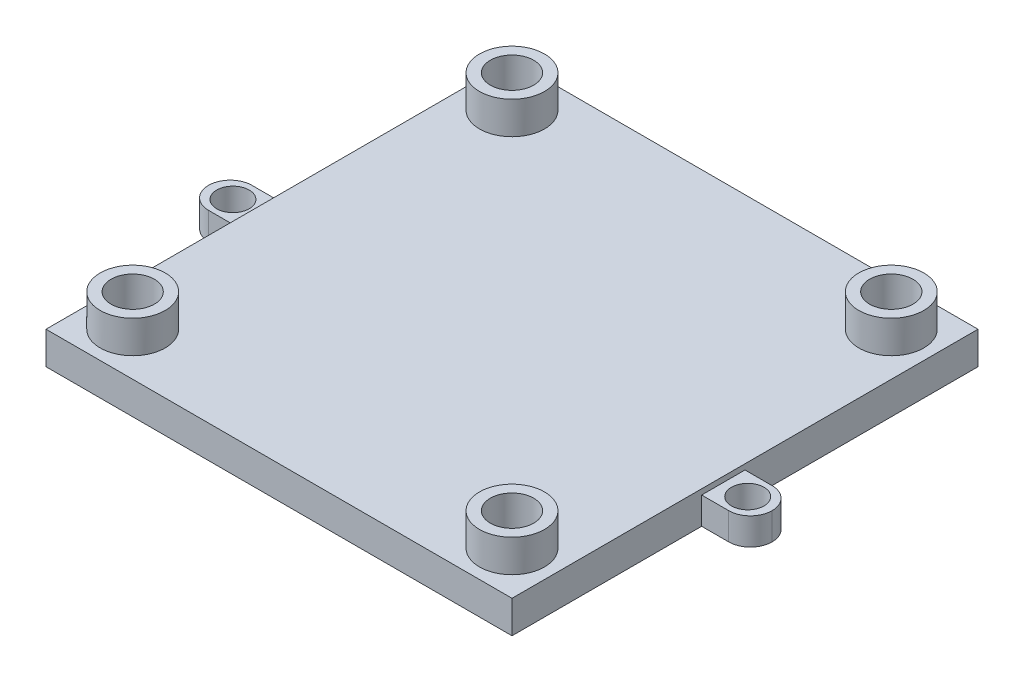
ISO-10303-21;
HEADER;
FILE_DESCRIPTION(('STEP AP214'),'2;1');
FILE_NAME('part.step','',(''),(''),'','','');
FILE_SCHEMA(('AUTOMOTIVE_DESIGN { 1 0 10303 214 1 1 1 1 }'));
ENDSEC;
DATA;
#1=APPLICATION_CONTEXT('core data for automotive mechanical design processes');
#2=APPLICATION_PROTOCOL_DEFINITION('international standard','automotive_design',2000,#1);
#3=PRODUCT_CONTEXT('',#1,'mechanical');
#4=PRODUCT('Part','Part','',(#3));
#5=PRODUCT_RELATED_PRODUCT_CATEGORY('part','',(#4));
#6=PRODUCT_DEFINITION_FORMATION('','',#4);
#7=PRODUCT_DEFINITION_CONTEXT('part definition',#1,'design');
#8=PRODUCT_DEFINITION('design','',#6,#7);
#9=PRODUCT_DEFINITION_SHAPE('','',#8);
#10=(LENGTH_UNIT() NAMED_UNIT(*) SI_UNIT(.MILLI.,.METRE.));
#11=(NAMED_UNIT(*) PLANE_ANGLE_UNIT() SI_UNIT($,.RADIAN.));
#12=(NAMED_UNIT(*) SI_UNIT($,.STERADIAN.) SOLID_ANGLE_UNIT());
#13=UNCERTAINTY_MEASURE_WITH_UNIT(LENGTH_MEASURE(1.E-05),#10,'distance_accuracy_value','');
#14=(GEOMETRIC_REPRESENTATION_CONTEXT(3) GLOBAL_UNCERTAINTY_ASSIGNED_CONTEXT((#13)) GLOBAL_UNIT_ASSIGNED_CONTEXT((#10,
#11,#12)) REPRESENTATION_CONTEXT('',''));
#15=CARTESIAN_POINT('',(0.,0.,0.));
#16=DIRECTION('',(0.,0.,1.));
#17=DIRECTION('',(1.,0.,0.));
#18=AXIS2_PLACEMENT_3D('',#15,#16,#17);
#19=CARTESIAN_POINT('',(43.,3.,0.));
#20=DIRECTION('',(-1.,0.,0.));
#21=DIRECTION('',(0.,0.,1.));
#22=AXIS2_PLACEMENT_3D('',#19,#20,#21);
#23=PLANE('',#22);
#24=DIRECTION('',(0.,-1.,0.));
#25=VECTOR('',#24,1.);
#26=CARTESIAN_POINT('',(43.,2.5,-17.5));
#27=LINE('',#26,#25);
#28=CARTESIAN_POINT('',(43.,2.5,-17.5));
#29=VERTEX_POINT('',#28);
#30=CARTESIAN_POINT('',(43.,0.,-17.5));
#31=VERTEX_POINT('',#30);
#32=EDGE_CURVE('E170',#29,#31,#27,.T.);
#33=ORIENTED_EDGE('',*,*,#32,.F.);
#34=DIRECTION('',(0.,0.,-1.));
#35=VECTOR('',#34,1.);
#36=CARTESIAN_POINT('',(43.,2.5,-21.5));
#37=LINE('',#36,#35);
#38=CARTESIAN_POINT('',(43.,2.5,-21.5));
#39=VERTEX_POINT('',#38);
#40=EDGE_CURVE('E175',#29,#39,#37,.T.);
#41=ORIENTED_EDGE('',*,*,#40,.T.);
#42=DIRECTION('',(0.,-1.,0.));
#43=VECTOR('',#42,1.);
#44=CARTESIAN_POINT('',(43.,2.5,-21.5));
#45=LINE('',#44,#43);
#46=CARTESIAN_POINT('',(43.,0.,-21.5));
#47=VERTEX_POINT('',#46);
#48=EDGE_CURVE('E159',#39,#47,#45,.T.);
#49=ORIENTED_EDGE('',*,*,#48,.T.);
#50=DIRECTION('',(0.,0.,-1.));
#51=VECTOR('',#50,1.);
#52=CARTESIAN_POINT('',(43.,0.,0.));
#53=LINE('',#52,#51);
#54=CARTESIAN_POINT('',(43.,0.,-43.));
#55=VERTEX_POINT('',#54);
#56=EDGE_CURVE('E259',#47,#55,#53,.T.);
#57=ORIENTED_EDGE('',*,*,#56,.T.);
#58=DIRECTION('',(0.,-1.,0.));
#59=VECTOR('',#58,1.);
#60=CARTESIAN_POINT('',(43.,3.,-43.));
#61=LINE('',#60,#59);
#62=CARTESIAN_POINT('',(43.,3.,-43.));
#63=VERTEX_POINT('',#62);
#64=EDGE_CURVE('E265',#63,#55,#61,.T.);
#65=ORIENTED_EDGE('',*,*,#64,.F.);
#66=DIRECTION('',(0.,0.,-1.));
#67=VECTOR('',#66,1.);
#68=CARTESIAN_POINT('',(43.,3.,0.));
#69=LINE('',#68,#67);
#70=CARTESIAN_POINT('',(43.,3.,0.));
#71=VERTEX_POINT('',#70);
#72=EDGE_CURVE('E249',#71,#63,#69,.T.);
#73=ORIENTED_EDGE('',*,*,#72,.F.);
#74=DIRECTION('',(0.,-1.,0.));
#75=VECTOR('',#74,1.);
#76=CARTESIAN_POINT('',(43.,3.,0.));
#77=LINE('',#76,#75);
#78=CARTESIAN_POINT('',(43.,0.,0.));
#79=VERTEX_POINT('',#78);
#80=EDGE_CURVE('E268',#71,#79,#77,.T.);
#81=ORIENTED_EDGE('',*,*,#80,.T.);
#82=EDGE_CURVE('E260',#79,#31,#53,.T.);
#83=ORIENTED_EDGE('',*,*,#82,.T.);
#84=EDGE_LOOP('',(#33,#41,#49,#57,#65,#73,#81,#83));
#85=FACE_BOUND('',#84,.T.);
#86=ADVANCED_FACE('F58',(#85),#23,.F.);
#87=CARTESIAN_POINT('',(0.,3.,0.));
#88=DIRECTION('',(1.,0.,0.));
#89=DIRECTION('',(0.,0.,-1.));
#90=AXIS2_PLACEMENT_3D('',#87,#88,#89);
#91=PLANE('',#90);
#92=DIRECTION('',(0.,-1.,0.));
#93=VECTOR('',#92,1.);
#94=CARTESIAN_POINT('',(0.,2.5,-21.5));
#95=LINE('',#94,#93);
#96=CARTESIAN_POINT('',(0.,2.5,-21.5));
#97=VERTEX_POINT('',#96);
#98=CARTESIAN_POINT('',(0.,0.,-21.5));
#99=VERTEX_POINT('',#98);
#100=EDGE_CURVE('E213',#97,#99,#95,.T.);
#101=ORIENTED_EDGE('',*,*,#100,.F.);
#102=DIRECTION('',(0.,0.,1.));
#103=VECTOR('',#102,1.);
#104=CARTESIAN_POINT('',(0.,2.5,-21.5));
#105=LINE('',#104,#103);
#106=CARTESIAN_POINT('',(0.,2.5,-17.5));
#107=VERTEX_POINT('',#106);
#108=EDGE_CURVE('E200',#97,#107,#105,.T.);
#109=ORIENTED_EDGE('',*,*,#108,.T.);
#110=DIRECTION('',(0.,-1.,0.));
#111=VECTOR('',#110,1.);
#112=CARTESIAN_POINT('',(0.,2.5,-17.5));
#113=LINE('',#112,#111);
#114=CARTESIAN_POINT('',(0.,0.,-17.5));
#115=VERTEX_POINT('',#114);
#116=EDGE_CURVE('E209',#107,#115,#113,.T.);
#117=ORIENTED_EDGE('',*,*,#116,.T.);
#118=DIRECTION('',(0.,0.,1.));
#119=VECTOR('',#118,1.);
#120=CARTESIAN_POINT('',(0.,0.,0.));
#121=LINE('',#120,#119);
#122=CARTESIAN_POINT('',(0.,0.,0.));
#123=VERTEX_POINT('',#122);
#124=EDGE_CURVE('E242',#115,#123,#121,.T.);
#125=ORIENTED_EDGE('',*,*,#124,.T.);
#126=DIRECTION('',(0.,-1.,0.));
#127=VECTOR('',#126,1.);
#128=CARTESIAN_POINT('',(0.,3.,0.));
#129=LINE('',#128,#127);
#130=CARTESIAN_POINT('',(0.,3.,0.));
#131=VERTEX_POINT('',#130);
#132=EDGE_CURVE('E271',#131,#123,#129,.T.);
#133=ORIENTED_EDGE('',*,*,#132,.F.);
#134=DIRECTION('',(0.,0.,1.));
#135=VECTOR('',#134,1.);
#136=CARTESIAN_POINT('',(0.,3.,0.));
#137=LINE('',#136,#135);
#138=CARTESIAN_POINT('',(0.,3.,-43.));
#139=VERTEX_POINT('',#138);
#140=EDGE_CURVE('E243',#139,#131,#137,.T.);
#141=ORIENTED_EDGE('',*,*,#140,.F.);
#142=DIRECTION('',(0.,-1.,0.));
#143=VECTOR('',#142,1.);
#144=CARTESIAN_POINT('',(0.,3.,-43.));
#145=LINE('',#144,#143);
#146=CARTESIAN_POINT('',(0.,0.,-43.));
#147=VERTEX_POINT('',#146);
#148=EDGE_CURVE('E253',#139,#147,#145,.T.);
#149=ORIENTED_EDGE('',*,*,#148,.T.);
#150=EDGE_CURVE('E254',#147,#99,#121,.T.);
#151=ORIENTED_EDGE('',*,*,#150,.T.);
#152=EDGE_LOOP('',(#101,#109,#117,#125,#133,#141,#149,#151));
#153=FACE_BOUND('',#152,.T.);
#154=ADVANCED_FACE('F356',(#153),#91,.F.);
#155=CARTESIAN_POINT('',(0.,3.,0.));
#156=DIRECTION('',(0.,0.,-1.));
#157=DIRECTION('',(-1.,0.,0.));
#158=AXIS2_PLACEMENT_3D('',#155,#156,#157);
#159=PLANE('',#158);
#160=DIRECTION('',(1.,0.,0.));
#161=VECTOR('',#160,1.);
#162=CARTESIAN_POINT('',(0.,0.,0.));
#163=LINE('',#162,#161);
#164=EDGE_CURVE('E257',#123,#79,#163,.T.);
#165=ORIENTED_EDGE('',*,*,#164,.T.);
#166=ORIENTED_EDGE('',*,*,#80,.F.);
#167=DIRECTION('',(1.,0.,0.));
#168=VECTOR('',#167,1.);
#169=CARTESIAN_POINT('',(0.,3.,0.));
#170=LINE('',#169,#168);
#171=EDGE_CURVE('E246',#131,#71,#170,.T.);
#172=ORIENTED_EDGE('',*,*,#171,.F.);
#173=ORIENTED_EDGE('',*,*,#132,.T.);
#174=EDGE_LOOP('',(#165,#166,#172,#173));
#175=FACE_BOUND('',#174,.T.);
#176=ADVANCED_FACE('F361',(#175),#159,.F.);
#177=CARTESIAN_POINT('',(0.,3.,-43.));
#178=DIRECTION('',(0.,0.,1.));
#179=DIRECTION('',(1.,0.,0.));
#180=AXIS2_PLACEMENT_3D('',#177,#178,#179);
#181=PLANE('',#180);
#182=DIRECTION('',(-1.,0.,0.));
#183=VECTOR('',#182,1.);
#184=CARTESIAN_POINT('',(0.,0.,-43.));
#185=LINE('',#184,#183);
#186=EDGE_CURVE('E247',#55,#147,#185,.T.);
#187=ORIENTED_EDGE('',*,*,#186,.T.);
#188=ORIENTED_EDGE('',*,*,#148,.F.);
#189=DIRECTION('',(-1.,0.,0.));
#190=VECTOR('',#189,1.);
#191=CARTESIAN_POINT('',(0.,3.,-43.));
#192=LINE('',#191,#190);
#193=EDGE_CURVE('E251',#63,#139,#192,.T.);
#194=ORIENTED_EDGE('',*,*,#193,.F.);
#195=ORIENTED_EDGE('',*,*,#64,.T.);
#196=EDGE_LOOP('',(#187,#188,#194,#195));
#197=FACE_BOUND('',#196,.T.);
#198=ADVANCED_FACE('F349',(#197),#181,.F.);
#199=CARTESIAN_POINT('',(0.,3.,0.));
#200=DIRECTION('',(0.,-1.,0.));
#201=DIRECTION('',(0.,0.,-1.));
#202=AXIS2_PLACEMENT_3D('',#199,#200,#201);
#203=PLANE('',#202);
#204=CARTESIAN_POINT('',(39.,3.,-4.));
#205=DIRECTION('',(0.,-1.,0.));
#206=DIRECTION('',(0.,0.,-1.));
#207=AXIS2_PLACEMENT_3D('',#204,#205,#206);
#208=CIRCLE('',#207,3.);
#209=CARTESIAN_POINT('',(39.,3.,-7.));
#210=VERTEX_POINT('',#209);
#211=EDGE_CURVE('E283',#210,#210,#208,.F.);
#212=ORIENTED_EDGE('',*,*,#211,.F.);
#213=EDGE_LOOP('',(#212));
#214=FACE_BOUND('',#213,.T.);
#215=CARTESIAN_POINT('',(4.,3.,-4.));
#216=DIRECTION('',(0.,-1.,0.));
#217=DIRECTION('',(0.,0.,-1.));
#218=AXIS2_PLACEMENT_3D('',#215,#216,#217);
#219=CIRCLE('',#218,3.);
#220=CARTESIAN_POINT('',(4.,3.,-7.));
#221=VERTEX_POINT('',#220);
#222=EDGE_CURVE('E280',#221,#221,#219,.F.);
#223=ORIENTED_EDGE('',*,*,#222,.F.);
#224=EDGE_LOOP('',(#223));
#225=FACE_BOUND('',#224,.T.);
#226=CARTESIAN_POINT('',(39.,3.,-39.));
#227=DIRECTION('',(0.,-1.,0.));
#228=DIRECTION('',(0.,0.,-1.));
#229=AXIS2_PLACEMENT_3D('',#226,#227,#228);
#230=CIRCLE('',#229,3.);
#231=CARTESIAN_POINT('',(39.,3.,-42.));
#232=VERTEX_POINT('',#231);
#233=EDGE_CURVE('E277',#232,#232,#230,.F.);
#234=ORIENTED_EDGE('',*,*,#233,.F.);
#235=EDGE_LOOP('',(#234));
#236=FACE_BOUND('',#235,.T.);
#237=CARTESIAN_POINT('',(4.,3.,-39.));
#238=DIRECTION('',(0.,-1.,0.));
#239=DIRECTION('',(0.,0.,-1.));
#240=AXIS2_PLACEMENT_3D('',#237,#238,#239);
#241=CIRCLE('',#240,3.);
#242=CARTESIAN_POINT('',(4.,3.,-42.));
#243=VERTEX_POINT('',#242);
#244=EDGE_CURVE('E274',#243,#243,#241,.F.);
#245=ORIENTED_EDGE('',*,*,#244,.F.);
#246=EDGE_LOOP('',(#245));
#247=FACE_BOUND('',#246,.T.);
#248=ORIENTED_EDGE('',*,*,#140,.T.);
#249=ORIENTED_EDGE('',*,*,#171,.T.);
#250=ORIENTED_EDGE('',*,*,#72,.T.);
#251=ORIENTED_EDGE('',*,*,#193,.T.);
#252=EDGE_LOOP('',(#248,#249,#250,#251));
#253=FACE_BOUND('',#252,.T.);
#254=ADVANCED_FACE('F339',(#214,#225,#236,#247,#253),#203,.F.);
#255=CARTESIAN_POINT('',(0.,0.,0.));
#256=DIRECTION('',(0.,-1.,0.));
#257=DIRECTION('',(0.,0.,-1.));
#258=AXIS2_PLACEMENT_3D('',#255,#256,#257);
#259=PLANE('',#258);
#260=CARTESIAN_POINT('',(4.,0.,-4.));
#261=DIRECTION('',(0.,1.,0.));
#262=DIRECTION('',(0.,0.,1.));
#263=AXIS2_PLACEMENT_3D('',#260,#261,#262);
#264=CIRCLE('',#263,2.);
#265=CARTESIAN_POINT('',(4.,0.,-2.));
#266=VERTEX_POINT('',#265);
#267=EDGE_CURVE('E324',#266,#266,#264,.T.);
#268=ORIENTED_EDGE('',*,*,#267,.T.);
#269=EDGE_LOOP('',(#268));
#270=FACE_BOUND('',#269,.T.);
#271=CARTESIAN_POINT('',(39.,0.,-4.));
#272=DIRECTION('',(0.,1.,0.));
#273=DIRECTION('',(0.,0.,1.));
#274=AXIS2_PLACEMENT_3D('',#271,#272,#273);
#275=CIRCLE('',#274,2.);
#276=CARTESIAN_POINT('',(39.,0.,-2.));
#277=VERTEX_POINT('',#276);
#278=EDGE_CURVE('E685',#277,#277,#275,.T.);
#279=ORIENTED_EDGE('',*,*,#278,.T.);
#280=EDGE_LOOP('',(#279));
#281=FACE_BOUND('',#280,.T.);
#282=CARTESIAN_POINT('',(39.,0.,-39.));
#283=DIRECTION('',(0.,1.,0.));
#284=DIRECTION('',(0.,0.,1.));
#285=AXIS2_PLACEMENT_3D('',#282,#283,#284);
#286=CIRCLE('',#285,2.);
#287=CARTESIAN_POINT('',(39.,0.,-37.));
#288=VERTEX_POINT('',#287);
#289=EDGE_CURVE('E319',#288,#288,#286,.T.);
#290=ORIENTED_EDGE('',*,*,#289,.T.);
#291=EDGE_LOOP('',(#290));
#292=FACE_BOUND('',#291,.T.);
#293=CARTESIAN_POINT('',(4.,0.,-39.));
#294=DIRECTION('',(0.,1.,0.));
#295=DIRECTION('',(0.,0.,1.));
#296=AXIS2_PLACEMENT_3D('',#293,#294,#295);
#297=CIRCLE('',#296,2.);
#298=CARTESIAN_POINT('',(4.,0.,-37.));
#299=VERTEX_POINT('',#298);
#300=EDGE_CURVE('E316',#299,#299,#297,.T.);
#301=ORIENTED_EDGE('',*,*,#300,.T.);
#302=EDGE_LOOP('',(#301));
#303=FACE_BOUND('',#302,.T.);
#304=DIRECTION('',(1.,0.,0.));
#305=VECTOR('',#304,1.);
#306=CARTESIAN_POINT('',(43.,0.,-21.5));
#307=LINE('',#306,#305);
#308=CARTESIAN_POINT('',(45.5,0.,-21.5));
#309=VERTEX_POINT('',#308);
#310=EDGE_CURVE('E166',#47,#309,#307,.T.);
#311=ORIENTED_EDGE('',*,*,#310,.T.);
#312=CARTESIAN_POINT('',(45.5,0.,-19.5));
#313=DIRECTION('',(0.,-1.,0.));
#314=DIRECTION('',(0.,0.,-1.));
#315=AXIS2_PLACEMENT_3D('',#312,#313,#314);
#316=CIRCLE('',#315,2.);
#317=CARTESIAN_POINT('',(47.5,0.,-19.5));
#318=VERTEX_POINT('',#317);
#319=EDGE_CURVE('E305',#309,#318,#316,.T.);
#320=ORIENTED_EDGE('',*,*,#319,.T.);
#321=CARTESIAN_POINT('',(45.5,0.,-19.5));
#322=DIRECTION('',(0.,-1.,0.));
#323=DIRECTION('',(0.,0.,-1.));
#324=AXIS2_PLACEMENT_3D('',#321,#322,#323);
#325=CIRCLE('',#324,2.);
#326=CARTESIAN_POINT('',(45.5,0.,-17.5));
#327=VERTEX_POINT('',#326);
#328=EDGE_CURVE('E303',#318,#327,#325,.T.);
#329=ORIENTED_EDGE('',*,*,#328,.T.);
#330=DIRECTION('',(-1.,0.,0.));
#331=VECTOR('',#330,1.);
#332=CARTESIAN_POINT('',(43.,0.,-17.5));
#333=LINE('',#332,#331);
#334=EDGE_CURVE('E181',#327,#31,#333,.T.);
#335=ORIENTED_EDGE('',*,*,#334,.T.);
#336=ORIENTED_EDGE('',*,*,#82,.F.);
#337=ORIENTED_EDGE('',*,*,#164,.F.);
#338=ORIENTED_EDGE('',*,*,#124,.F.);
#339=DIRECTION('',(-1.,0.,0.));
#340=VECTOR('',#339,1.);
#341=CARTESIAN_POINT('',(0.,0.,-17.5));
#342=LINE('',#341,#340);
#343=CARTESIAN_POINT('',(-2.5,0.,-17.5));
#344=VERTEX_POINT('',#343);
#345=EDGE_CURVE('E196',#115,#344,#342,.T.);
#346=ORIENTED_EDGE('',*,*,#345,.T.);
#347=CARTESIAN_POINT('',(-2.5,0.,-19.5));
#348=DIRECTION('',(0.,-1.,0.));
#349=DIRECTION('',(0.,0.,-1.));
#350=AXIS2_PLACEMENT_3D('',#347,#348,#349);
#351=CIRCLE('',#350,2.);
#352=CARTESIAN_POINT('',(-4.5,0.,-19.5));
#353=VERTEX_POINT('',#352);
#354=EDGE_CURVE('E286',#344,#353,#351,.T.);
#355=ORIENTED_EDGE('',*,*,#354,.T.);
#356=CARTESIAN_POINT('',(-2.5,0.,-19.5));
#357=DIRECTION('',(0.,-1.,0.));
#358=DIRECTION('',(0.,0.,-1.));
#359=AXIS2_PLACEMENT_3D('',#356,#357,#358);
#360=CIRCLE('',#359,2.);
#361=CARTESIAN_POINT('',(-2.5,0.,-21.5));
#362=VERTEX_POINT('',#361);
#363=EDGE_CURVE('E288',#353,#362,#360,.T.);
#364=ORIENTED_EDGE('',*,*,#363,.T.);
#365=DIRECTION('',(1.,0.,0.));
#366=VECTOR('',#365,1.);
#367=CARTESIAN_POINT('',(0.,0.,-21.5));
#368=LINE('',#367,#366);
#369=EDGE_CURVE('E204',#362,#99,#368,.T.);
#370=ORIENTED_EDGE('',*,*,#369,.T.);
#371=ORIENTED_EDGE('',*,*,#150,.F.);
#372=ORIENTED_EDGE('',*,*,#186,.F.);
#373=ORIENTED_EDGE('',*,*,#56,.F.);
#374=EDGE_LOOP('',(#311,#320,#329,#335,#336,#337,#338,#346,#355,#364,#370,#371,#372,#373));
#375=FACE_BOUND('',#374,.T.);
#376=CARTESIAN_POINT('',(-2.25,0.,-19.5));
#377=DIRECTION('',(0.,-1.,0.));
#378=DIRECTION('',(0.,0.,-1.));
#379=AXIS2_PLACEMENT_3D('',#376,#377,#378);
#380=CIRCLE('',#379,1.5);
#381=CARTESIAN_POINT('',(-2.25,0.,-21.));
#382=VERTEX_POINT('',#381);
#383=EDGE_CURVE('E197',#382,#382,#380,.T.);
#384=ORIENTED_EDGE('',*,*,#383,.F.);
#385=EDGE_LOOP('',(#384));
#386=FACE_BOUND('',#385,.T.);
#387=CARTESIAN_POINT('',(45.25,0.,-19.5));
#388=DIRECTION('',(0.,-1.,0.));
#389=DIRECTION('',(0.,0.,-1.));
#390=AXIS2_PLACEMENT_3D('',#387,#388,#389);
#391=CIRCLE('',#390,1.5);
#392=CARTESIAN_POINT('',(45.25,0.,-21.));
#393=VERTEX_POINT('',#392);
#394=EDGE_CURVE('E185',#393,#393,#391,.T.);
#395=ORIENTED_EDGE('',*,*,#394,.F.);
#396=EDGE_LOOP('',(#395));
#397=FACE_BOUND('',#396,.T.);
#398=ADVANCED_FACE('F310',(#270,#281,#292,#303,#375,#386,#397),#259,.T.);
#399=CARTESIAN_POINT('',(4.,6.,-39.));
#400=DIRECTION('',(0.,1.,0.));
#401=DIRECTION('',(0.,0.,1.));
#402=AXIS2_PLACEMENT_3D('',#399,#400,#401);
#403=PLANE('',#402);
#404=CARTESIAN_POINT('',(4.,6.,-39.));
#405=DIRECTION('',(0.,1.,0.));
#406=DIRECTION('',(0.,0.,1.));
#407=AXIS2_PLACEMENT_3D('',#404,#405,#406);
#408=CIRCLE('',#407,3.);
#409=CARTESIAN_POINT('',(4.,6.,-36.));
#410=VERTEX_POINT('',#409);
#411=EDGE_CURVE('E239',#410,#410,#408,.T.);
#412=ORIENTED_EDGE('',*,*,#411,.T.);
#413=EDGE_LOOP('',(#412));
#414=FACE_BOUND('',#413,.T.);
#415=CARTESIAN_POINT('',(4.,6.,-39.));
#416=DIRECTION('',(0.,1.,0.));
#417=DIRECTION('',(0.,0.,1.));
#418=AXIS2_PLACEMENT_3D('',#415,#416,#417);
#419=CIRCLE('',#418,2.);
#420=CARTESIAN_POINT('',(4.,6.,-37.));
#421=VERTEX_POINT('',#420);
#422=EDGE_CURVE('E236',#421,#421,#419,.T.);
#423=ORIENTED_EDGE('',*,*,#422,.F.);
#424=EDGE_LOOP('',(#423));
#425=FACE_BOUND('',#424,.T.);
#426=ADVANCED_FACE('F338',(#414,#425),#403,.T.);
#427=CARTESIAN_POINT('',(4.,6.,-39.));
#428=DIRECTION('',(0.,-1.,0.));
#429=DIRECTION('',(0.,0.,-1.));
#430=AXIS2_PLACEMENT_3D('',#427,#428,#429);
#431=CYLINDRICAL_SURFACE('',#430,3.);
#432=ORIENTED_EDGE('',*,*,#411,.F.);
#433=EDGE_LOOP('',(#432));
#434=FACE_BOUND('',#433,.T.);
#435=ORIENTED_EDGE('',*,*,#244,.T.);
#436=EDGE_LOOP('',(#435));
#437=FACE_BOUND('',#436,.T.);
#438=ADVANCED_FACE('F346',(#434,#437),#431,.T.);
#439=CARTESIAN_POINT('',(4.,6.,-39.));
#440=DIRECTION('',(0.,-1.,0.));
#441=DIRECTION('',(0.,0.,-1.));
#442=AXIS2_PLACEMENT_3D('',#439,#440,#441);
#443=CYLINDRICAL_SURFACE('',#442,2.);
#444=ORIENTED_EDGE('',*,*,#422,.T.);
#445=EDGE_LOOP('',(#444));
#446=FACE_BOUND('',#445,.T.);
#447=ORIENTED_EDGE('',*,*,#300,.F.);
#448=EDGE_LOOP('',(#447));
#449=FACE_BOUND('',#448,.T.);
#450=ADVANCED_FACE('F518',(#446,#449),#443,.F.);
#451=CARTESIAN_POINT('',(39.,6.,-39.));
#452=DIRECTION('',(0.,1.,0.));
#453=DIRECTION('',(0.,0.,1.));
#454=AXIS2_PLACEMENT_3D('',#451,#452,#453);
#455=PLANE('',#454);
#456=CARTESIAN_POINT('',(39.,6.,-39.));
#457=DIRECTION('',(0.,1.,0.));
#458=DIRECTION('',(0.,0.,1.));
#459=AXIS2_PLACEMENT_3D('',#456,#457,#458);
#460=CIRCLE('',#459,3.);
#461=CARTESIAN_POINT('',(39.,6.,-36.));
#462=VERTEX_POINT('',#461);
#463=EDGE_CURVE('E233',#462,#462,#460,.T.);
#464=ORIENTED_EDGE('',*,*,#463,.T.);
#465=EDGE_LOOP('',(#464));
#466=FACE_BOUND('',#465,.T.);
#467=CARTESIAN_POINT('',(39.,6.,-39.));
#468=DIRECTION('',(0.,1.,0.));
#469=DIRECTION('',(0.,0.,1.));
#470=AXIS2_PLACEMENT_3D('',#467,#468,#469);
#471=CIRCLE('',#470,2.);
#472=CARTESIAN_POINT('',(39.,6.,-37.));
#473=VERTEX_POINT('',#472);
#474=EDGE_CURVE('E230',#473,#473,#471,.T.);
#475=ORIENTED_EDGE('',*,*,#474,.F.);
#476=EDGE_LOOP('',(#475));
#477=FACE_BOUND('',#476,.T.);
#478=ADVANCED_FACE('F510',(#466,#477),#455,.T.);
#479=CARTESIAN_POINT('',(39.,6.,-39.));
#480=DIRECTION('',(0.,-1.,0.));
#481=DIRECTION('',(0.,0.,-1.));
#482=AXIS2_PLACEMENT_3D('',#479,#480,#481);
#483=CYLINDRICAL_SURFACE('',#482,3.);
#484=ORIENTED_EDGE('',*,*,#463,.F.);
#485=EDGE_LOOP('',(#484));
#486=FACE_BOUND('',#485,.T.);
#487=ORIENTED_EDGE('',*,*,#233,.T.);
#488=EDGE_LOOP('',(#487));
#489=FACE_BOUND('',#488,.T.);
#490=ADVANCED_FACE('F502',(#486,#489),#483,.T.);
#491=CARTESIAN_POINT('',(39.,6.,-39.));
#492=DIRECTION('',(0.,-1.,0.));
#493=DIRECTION('',(0.,0.,-1.));
#494=AXIS2_PLACEMENT_3D('',#491,#492,#493);
#495=CYLINDRICAL_SURFACE('',#494,2.);
#496=ORIENTED_EDGE('',*,*,#474,.T.);
#497=EDGE_LOOP('',(#496));
#498=FACE_BOUND('',#497,.T.);
#499=ORIENTED_EDGE('',*,*,#289,.F.);
#500=EDGE_LOOP('',(#499));
#501=FACE_BOUND('',#500,.T.);
#502=ADVANCED_FACE('F493',(#498,#501),#495,.F.);
#503=CARTESIAN_POINT('',(4.,6.,-4.));
#504=DIRECTION('',(0.,1.,0.));
#505=DIRECTION('',(0.,0.,1.));
#506=AXIS2_PLACEMENT_3D('',#503,#504,#505);
#507=PLANE('',#506);
#508=CARTESIAN_POINT('',(4.,6.,-4.));
#509=DIRECTION('',(0.,1.,0.));
#510=DIRECTION('',(0.,0.,1.));
#511=AXIS2_PLACEMENT_3D('',#508,#509,#510);
#512=CIRCLE('',#511,3.);
#513=CARTESIAN_POINT('',(4.,6.,-0.999999999999999));
#514=VERTEX_POINT('',#513);
#515=EDGE_CURVE('E227',#514,#514,#512,.T.);
#516=ORIENTED_EDGE('',*,*,#515,.T.);
#517=EDGE_LOOP('',(#516));
#518=FACE_BOUND('',#517,.T.);
#519=CARTESIAN_POINT('',(4.,6.,-4.));
#520=DIRECTION('',(0.,1.,0.));
#521=DIRECTION('',(0.,0.,1.));
#522=AXIS2_PLACEMENT_3D('',#519,#520,#521);
#523=CIRCLE('',#522,2.);
#524=CARTESIAN_POINT('',(4.,6.,-2.));
#525=VERTEX_POINT('',#524);
#526=EDGE_CURVE('E224',#525,#525,#523,.T.);
#527=ORIENTED_EDGE('',*,*,#526,.F.);
#528=EDGE_LOOP('',(#527));
#529=FACE_BOUND('',#528,.T.);
#530=ADVANCED_FACE('F485',(#518,#529),#507,.T.);
#531=CARTESIAN_POINT('',(4.,6.,-4.));
#532=DIRECTION('',(0.,-1.,0.));
#533=DIRECTION('',(0.,0.,-1.));
#534=AXIS2_PLACEMENT_3D('',#531,#532,#533);
#535=CYLINDRICAL_SURFACE('',#534,3.);
#536=ORIENTED_EDGE('',*,*,#515,.F.);
#537=EDGE_LOOP('',(#536));
#538=FACE_BOUND('',#537,.T.);
#539=ORIENTED_EDGE('',*,*,#222,.T.);
#540=EDGE_LOOP('',(#539));
#541=FACE_BOUND('',#540,.T.);
#542=ADVANCED_FACE('F477',(#538,#541),#535,.T.);
#543=CARTESIAN_POINT('',(4.,6.,-4.));
#544=DIRECTION('',(0.,-1.,0.));
#545=DIRECTION('',(0.,0.,-1.));
#546=AXIS2_PLACEMENT_3D('',#543,#544,#545);
#547=CYLINDRICAL_SURFACE('',#546,2.);
#548=ORIENTED_EDGE('',*,*,#526,.T.);
#549=EDGE_LOOP('',(#548));
#550=FACE_BOUND('',#549,.T.);
#551=ORIENTED_EDGE('',*,*,#267,.F.);
#552=EDGE_LOOP('',(#551));
#553=FACE_BOUND('',#552,.T.);
#554=ADVANCED_FACE('F469',(#550,#553),#547,.F.);
#555=CARTESIAN_POINT('',(39.,6.,-4.));
#556=DIRECTION('',(0.,1.,0.));
#557=DIRECTION('',(0.,0.,1.));
#558=AXIS2_PLACEMENT_3D('',#555,#556,#557);
#559=PLANE('',#558);
#560=CARTESIAN_POINT('',(39.,6.,-4.));
#561=DIRECTION('',(0.,1.,0.));
#562=DIRECTION('',(0.,0.,1.));
#563=AXIS2_PLACEMENT_3D('',#560,#561,#562);
#564=CIRCLE('',#563,3.);
#565=CARTESIAN_POINT('',(39.,6.,-0.999999999999999));
#566=VERTEX_POINT('',#565);
#567=EDGE_CURVE('E221',#566,#566,#564,.T.);
#568=ORIENTED_EDGE('',*,*,#567,.T.);
#569=EDGE_LOOP('',(#568));
#570=FACE_BOUND('',#569,.T.);
#571=CARTESIAN_POINT('',(39.,6.,-4.));
#572=DIRECTION('',(0.,1.,0.));
#573=DIRECTION('',(0.,0.,1.));
#574=AXIS2_PLACEMENT_3D('',#571,#572,#573);
#575=CIRCLE('',#574,2.);
#576=CARTESIAN_POINT('',(39.,6.,-2.));
#577=VERTEX_POINT('',#576);
#578=EDGE_CURVE('E216',#577,#577,#575,.T.);
#579=ORIENTED_EDGE('',*,*,#578,.F.);
#580=EDGE_LOOP('',(#579));
#581=FACE_BOUND('',#580,.T.);
#582=ADVANCED_FACE('F461',(#570,#581),#559,.T.);
#583=CARTESIAN_POINT('',(39.,6.,-4.));
#584=DIRECTION('',(0.,-1.,0.));
#585=DIRECTION('',(0.,0.,-1.));
#586=AXIS2_PLACEMENT_3D('',#583,#584,#585);
#587=CYLINDRICAL_SURFACE('',#586,3.);
#588=ORIENTED_EDGE('',*,*,#567,.F.);
#589=EDGE_LOOP('',(#588));
#590=FACE_BOUND('',#589,.T.);
#591=ORIENTED_EDGE('',*,*,#211,.T.);
#592=EDGE_LOOP('',(#591));
#593=FACE_BOUND('',#592,.T.);
#594=ADVANCED_FACE('F452',(#590,#593),#587,.T.);
#595=CARTESIAN_POINT('',(39.,6.,-4.));
#596=DIRECTION('',(0.,-1.,0.));
#597=DIRECTION('',(0.,0.,-1.));
#598=AXIS2_PLACEMENT_3D('',#595,#596,#597);
#599=CYLINDRICAL_SURFACE('',#598,2.);
#600=ORIENTED_EDGE('',*,*,#578,.T.);
#601=EDGE_LOOP('',(#600));
#602=FACE_BOUND('',#601,.T.);
#603=ORIENTED_EDGE('',*,*,#278,.F.);
#604=EDGE_LOOP('',(#603));
#605=FACE_BOUND('',#604,.T.);
#606=ADVANCED_FACE('F444',(#602,#605),#599,.F.);
#607=CARTESIAN_POINT('',(0.,2.5,-21.5));
#608=DIRECTION('',(0.,0.,-1.));
#609=DIRECTION('',(-1.,0.,0.));
#610=AXIS2_PLACEMENT_3D('',#607,#608,#609);
#611=PLANE('',#610);
#612=ORIENTED_EDGE('',*,*,#369,.F.);
#613=DIRECTION('',(0.,-1.,0.));
#614=VECTOR('',#613,1.);
#615=CARTESIAN_POINT('',(-2.5,2.5,-21.5));
#616=LINE('',#615,#614);
#617=CARTESIAN_POINT('',(-2.5,2.5,-21.5));
#618=VERTEX_POINT('',#617);
#619=EDGE_CURVE('E290',#362,#618,#616,.F.);
#620=ORIENTED_EDGE('',*,*,#619,.T.);
#621=DIRECTION('',(1.,0.,0.));
#622=VECTOR('',#621,1.);
#623=CARTESIAN_POINT('',(0.,2.5,-21.5));
#624=LINE('',#623,#622);
#625=EDGE_CURVE('E207',#618,#97,#624,.T.);
#626=ORIENTED_EDGE('',*,*,#625,.T.);
#627=ORIENTED_EDGE('',*,*,#100,.T.);
#628=EDGE_LOOP('',(#612,#620,#626,#627));
#629=FACE_BOUND('',#628,.T.);
#630=ADVANCED_FACE('F437',(#629),#611,.T.);
#631=CARTESIAN_POINT('',(0.,2.5,-17.5));
#632=DIRECTION('',(0.,0.,1.));
#633=DIRECTION('',(1.,0.,0.));
#634=AXIS2_PLACEMENT_3D('',#631,#632,#633);
#635=PLANE('',#634);
#636=DIRECTION('',(-1.,0.,0.));
#637=VECTOR('',#636,1.);
#638=CARTESIAN_POINT('',(0.,2.5,-17.5));
#639=LINE('',#638,#637);
#640=CARTESIAN_POINT('',(-2.5,2.5,-17.5));
#641=VERTEX_POINT('',#640);
#642=EDGE_CURVE('E203',#107,#641,#639,.T.);
#643=ORIENTED_EDGE('',*,*,#642,.T.);
#644=DIRECTION('',(0.,-1.,0.));
#645=VECTOR('',#644,1.);
#646=CARTESIAN_POINT('',(-2.5,2.5,-17.5));
#647=LINE('',#646,#645);
#648=EDGE_CURVE('E297',#641,#344,#647,.T.);
#649=ORIENTED_EDGE('',*,*,#648,.T.);
#650=ORIENTED_EDGE('',*,*,#345,.F.);
#651=ORIENTED_EDGE('',*,*,#116,.F.);
#652=EDGE_LOOP('',(#643,#649,#650,#651));
#653=FACE_BOUND('',#652,.T.);
#654=ADVANCED_FACE('F429',(#653),#635,.T.);
#655=CARTESIAN_POINT('',(0.,2.5,0.));
#656=DIRECTION('',(0.,-1.,0.));
#657=DIRECTION('',(0.,0.,-1.));
#658=AXIS2_PLACEMENT_3D('',#655,#656,#657);
#659=PLANE('',#658);
#660=CARTESIAN_POINT('',(-2.25,2.5,-19.5));
#661=DIRECTION('',(0.,-1.,0.));
#662=DIRECTION('',(0.,0.,-1.));
#663=AXIS2_PLACEMENT_3D('',#660,#661,#662);
#664=CIRCLE('',#663,1.5);
#665=CARTESIAN_POINT('',(-2.25,2.5,-21.));
#666=VERTEX_POINT('',#665);
#667=EDGE_CURVE('E193',#666,#666,#664,.T.);
#668=ORIENTED_EDGE('',*,*,#667,.T.);
#669=EDGE_LOOP('',(#668));
#670=FACE_BOUND('',#669,.T.);
#671=ORIENTED_EDGE('',*,*,#625,.F.);
#672=CARTESIAN_POINT('',(-2.5,2.5,-19.5));
#673=DIRECTION('',(0.,-1.,0.));
#674=DIRECTION('',(0.,0.,-1.));
#675=AXIS2_PLACEMENT_3D('',#672,#673,#674);
#676=CIRCLE('',#675,2.);
#677=CARTESIAN_POINT('',(-4.5,2.5,-19.5));
#678=VERTEX_POINT('',#677);
#679=EDGE_CURVE('E295',#618,#678,#676,.F.);
#680=ORIENTED_EDGE('',*,*,#679,.T.);
#681=CARTESIAN_POINT('',(-2.5,2.5,-19.5));
#682=DIRECTION('',(0.,-1.,0.));
#683=DIRECTION('',(0.,0.,-1.));
#684=AXIS2_PLACEMENT_3D('',#681,#682,#683);
#685=CIRCLE('',#684,2.);
#686=EDGE_CURVE('E293',#678,#641,#685,.F.);
#687=ORIENTED_EDGE('',*,*,#686,.T.);
#688=ORIENTED_EDGE('',*,*,#642,.F.);
#689=ORIENTED_EDGE('',*,*,#108,.F.);
#690=EDGE_LOOP('',(#671,#680,#687,#688,#689));
#691=FACE_BOUND('',#690,.T.);
#692=ADVANCED_FACE('F420',(#670,#691),#659,.F.);
#693=CARTESIAN_POINT('',(-2.25,2.5,-19.5));
#694=DIRECTION('',(0.,-1.,0.));
#695=DIRECTION('',(0.,0.,-1.));
#696=AXIS2_PLACEMENT_3D('',#693,#694,#695);
#697=CYLINDRICAL_SURFACE('',#696,1.5);
#698=ORIENTED_EDGE('',*,*,#667,.F.);
#699=EDGE_LOOP('',(#698));
#700=FACE_BOUND('',#699,.T.);
#701=ORIENTED_EDGE('',*,*,#383,.T.);
#702=EDGE_LOOP('',(#701));
#703=FACE_BOUND('',#702,.T.);
#704=ADVANCED_FACE('F375',(#700,#703),#697,.F.);
#705=CARTESIAN_POINT('',(-2.5,2.5,-19.5));
#706=DIRECTION('',(0.,-1.,0.));
#707=DIRECTION('',(0.,0.,-1.));
#708=AXIS2_PLACEMENT_3D('',#705,#706,#707);
#709=CYLINDRICAL_SURFACE('',#708,2.);
#710=ORIENTED_EDGE('',*,*,#648,.F.);
#711=ORIENTED_EDGE('',*,*,#686,.F.);
#712=DIRECTION('',(0.,-1.,0.));
#713=VECTOR('',#712,1.);
#714=CARTESIAN_POINT('',(-4.5,2.5,-19.5));
#715=LINE('',#714,#713);
#716=EDGE_CURVE('E191',#353,#678,#715,.F.);
#717=ORIENTED_EDGE('',*,*,#716,.F.);
#718=ORIENTED_EDGE('',*,*,#354,.F.);
#719=EDGE_LOOP('',(#710,#711,#717,#718));
#720=FACE_BOUND('',#719,.T.);
#721=ADVANCED_FACE('F372',(#720),#709,.T.);
#722=CARTESIAN_POINT('',(-2.5,2.5,-19.5));
#723=DIRECTION('',(0.,-1.,0.));
#724=DIRECTION('',(0.,0.,-1.));
#725=AXIS2_PLACEMENT_3D('',#722,#723,#724);
#726=CYLINDRICAL_SURFACE('',#725,2.);
#727=ORIENTED_EDGE('',*,*,#679,.F.);
#728=ORIENTED_EDGE('',*,*,#619,.F.);
#729=ORIENTED_EDGE('',*,*,#363,.F.);
#730=ORIENTED_EDGE('',*,*,#716,.T.);
#731=EDGE_LOOP('',(#727,#728,#729,#730));
#732=FACE_BOUND('',#731,.T.);
#733=ADVANCED_FACE('F368',(#732),#726,.T.);
#734=CARTESIAN_POINT('',(43.,2.5,-17.5));
#735=DIRECTION('',(0.,0.,1.));
#736=DIRECTION('',(1.,0.,0.));
#737=AXIS2_PLACEMENT_3D('',#734,#735,#736);
#738=PLANE('',#737);
#739=ORIENTED_EDGE('',*,*,#334,.F.);
#740=DIRECTION('',(0.,-1.,0.));
#741=VECTOR('',#740,1.);
#742=CARTESIAN_POINT('',(45.5,2.5,-17.5));
#743=LINE('',#742,#741);
#744=CARTESIAN_POINT('',(45.5,2.5,-17.5));
#745=VERTEX_POINT('',#744);
#746=EDGE_CURVE('E12',#327,#745,#743,.F.);
#747=ORIENTED_EDGE('',*,*,#746,.T.);
#748=DIRECTION('',(-1.,0.,0.));
#749=VECTOR('',#748,1.);
#750=CARTESIAN_POINT('',(43.,2.5,-17.5));
#751=LINE('',#750,#749);
#752=EDGE_CURVE('E171',#745,#29,#751,.T.);
#753=ORIENTED_EDGE('',*,*,#752,.T.);
#754=ORIENTED_EDGE('',*,*,#32,.T.);
#755=EDGE_LOOP('',(#739,#747,#753,#754));
#756=FACE_BOUND('',#755,.T.);
#757=ADVANCED_FACE('F371',(#756),#738,.T.);
#758=CARTESIAN_POINT('',(43.,2.5,-21.5));
#759=DIRECTION('',(0.,0.,-1.));
#760=DIRECTION('',(-1.,0.,0.));
#761=AXIS2_PLACEMENT_3D('',#758,#759,#760);
#762=PLANE('',#761);
#763=DIRECTION('',(1.,0.,0.));
#764=VECTOR('',#763,1.);
#765=CARTESIAN_POINT('',(43.,2.5,-21.5));
#766=LINE('',#765,#764);
#767=CARTESIAN_POINT('',(45.5,2.5,-21.5));
#768=VERTEX_POINT('',#767);
#769=EDGE_CURVE('E163',#39,#768,#766,.T.);
#770=ORIENTED_EDGE('',*,*,#769,.T.);
#771=DIRECTION('',(0.,-1.,0.));
#772=VECTOR('',#771,1.);
#773=CARTESIAN_POINT('',(45.5,2.5,-21.5));
#774=LINE('',#773,#772);
#775=EDGE_CURVE('E299',#768,#309,#774,.T.);
#776=ORIENTED_EDGE('',*,*,#775,.T.);
#777=ORIENTED_EDGE('',*,*,#310,.F.);
#778=ORIENTED_EDGE('',*,*,#48,.F.);
#779=EDGE_LOOP('',(#770,#776,#777,#778));
#780=FACE_BOUND('',#779,.T.);
#781=ADVANCED_FACE('F161',(#780),#762,.T.);
#782=CARTESIAN_POINT('',(0.,2.5,0.));
#783=DIRECTION('',(0.,1.,0.));
#784=DIRECTION('',(0.,0.,1.));
#785=AXIS2_PLACEMENT_3D('',#782,#783,#784);
#786=PLANE('',#785);
#787=CARTESIAN_POINT('',(45.25,2.5,-19.5));
#788=DIRECTION('',(0.,-1.,0.));
#789=DIRECTION('',(0.,0.,-1.));
#790=AXIS2_PLACEMENT_3D('',#787,#788,#789);
#791=CIRCLE('',#790,1.5);
#792=CARTESIAN_POINT('',(45.25,2.5,-21.));
#793=VERTEX_POINT('',#792);
#794=EDGE_CURVE('E189',#793,#793,#791,.T.);
#795=ORIENTED_EDGE('',*,*,#794,.T.);
#796=EDGE_LOOP('',(#795));
#797=FACE_BOUND('',#796,.T.);
#798=CARTESIAN_POINT('',(45.5,2.5,-19.5));
#799=DIRECTION('',(0.,1.,0.));
#800=DIRECTION('',(0.,0.,1.));
#801=AXIS2_PLACEMENT_3D('',#798,#799,#800);
#802=CIRCLE('',#801,2.);
#803=CARTESIAN_POINT('',(47.5,2.5,-19.5));
#804=VERTEX_POINT('',#803);
#805=EDGE_CURVE('E74',#745,#804,#802,.T.);
#806=ORIENTED_EDGE('',*,*,#805,.T.);
#807=CARTESIAN_POINT('',(45.5,2.5,-19.5));
#808=DIRECTION('',(0.,1.,0.));
#809=DIRECTION('',(0.,0.,1.));
#810=AXIS2_PLACEMENT_3D('',#807,#808,#809);
#811=CIRCLE('',#810,2.);
#812=EDGE_CURVE('E67',#804,#768,#811,.T.);
#813=ORIENTED_EDGE('',*,*,#812,.T.);
#814=ORIENTED_EDGE('',*,*,#769,.F.);
#815=ORIENTED_EDGE('',*,*,#40,.F.);
#816=ORIENTED_EDGE('',*,*,#752,.F.);
#817=EDGE_LOOP('',(#806,#813,#814,#815,#816));
#818=FACE_BOUND('',#817,.T.);
#819=ADVANCED_FACE('F174',(#797,#818),#786,.T.);
#820=CARTESIAN_POINT('',(45.25,2.5,-19.5));
#821=DIRECTION('',(0.,-1.,0.));
#822=DIRECTION('',(0.,0.,-1.));
#823=AXIS2_PLACEMENT_3D('',#820,#821,#822);
#824=CYLINDRICAL_SURFACE('',#823,1.5);
#825=ORIENTED_EDGE('',*,*,#794,.F.);
#826=EDGE_LOOP('',(#825));
#827=FACE_BOUND('',#826,.T.);
#828=ORIENTED_EDGE('',*,*,#394,.T.);
#829=EDGE_LOOP('',(#828));
#830=FACE_BOUND('',#829,.T.);
#831=ADVANCED_FACE('F331',(#827,#830),#824,.F.);
#832=CARTESIAN_POINT('',(45.5,2.5,-19.5));
#833=DIRECTION('',(0.,-1.,0.));
#834=DIRECTION('',(0.,0.,-1.));
#835=AXIS2_PLACEMENT_3D('',#832,#833,#834);
#836=CYLINDRICAL_SURFACE('',#835,2.);
#837=DIRECTION('',(0.,-1.,0.));
#838=VECTOR('',#837,1.);
#839=CARTESIAN_POINT('',(47.5,2.5,-19.5));
#840=LINE('',#839,#838);
#841=EDGE_CURVE('E62',#804,#318,#840,.T.);
#842=ORIENTED_EDGE('',*,*,#841,.F.);
#843=ORIENTED_EDGE('',*,*,#805,.F.);
#844=ORIENTED_EDGE('',*,*,#746,.F.);
#845=ORIENTED_EDGE('',*,*,#328,.F.);
#846=EDGE_LOOP('',(#842,#843,#844,#845));
#847=FACE_BOUND('',#846,.T.);
#848=ADVANCED_FACE('F60',(#847),#836,.T.);
#849=CARTESIAN_POINT('',(45.5,2.5,-19.5));
#850=DIRECTION('',(0.,-1.,0.));
#851=DIRECTION('',(0.,0.,-1.));
#852=AXIS2_PLACEMENT_3D('',#849,#850,#851);
#853=CYLINDRICAL_SURFACE('',#852,2.);
#854=ORIENTED_EDGE('',*,*,#812,.F.);
#855=ORIENTED_EDGE('',*,*,#841,.T.);
#856=ORIENTED_EDGE('',*,*,#319,.F.);
#857=ORIENTED_EDGE('',*,*,#775,.F.);
#858=EDGE_LOOP('',(#854,#855,#856,#857));
#859=FACE_BOUND('',#858,.T.);
#860=ADVANCED_FACE('F315',(#859),#853,.T.);
#861=CLOSED_SHELL('',(#86,#154,#176,#198,#254,#398,#426,#438,#450,#478,#490,#502,#530,#542,#554,
#582,#594,#606,#630,#654,#692,#704,#721,#733,#757,#781,#819,#831,#848,#860));
#862=MANIFOLD_SOLID_BREP('B2',#861);
#863=ADVANCED_BREP_SHAPE_REPRESENTATION('',(#18,#862),#14);
#864=SHAPE_DEFINITION_REPRESENTATION(#9,#863);
ENDSEC;
END-ISO-10303-21;
